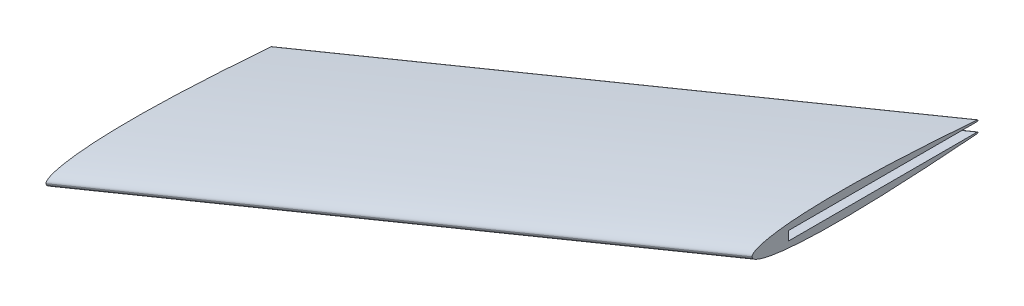
ISO-10303-21;
HEADER;
FILE_DESCRIPTION(('STEP AP214'),'2;1');
FILE_NAME('part.step','',(''),(''),'','','');
FILE_SCHEMA(('AUTOMOTIVE_DESIGN { 1 0 10303 214 1 1 1 1 }'));
ENDSEC;
DATA;
#1=APPLICATION_CONTEXT('core data for automotive mechanical design processes');
#2=APPLICATION_PROTOCOL_DEFINITION('international standard','automotive_design',2000,#1);
#3=PRODUCT_CONTEXT('',#1,'mechanical');
#4=PRODUCT('Part','Part','',(#3));
#5=PRODUCT_RELATED_PRODUCT_CATEGORY('part','',(#4));
#6=PRODUCT_DEFINITION_FORMATION('','',#4);
#7=PRODUCT_DEFINITION_CONTEXT('part definition',#1,'design');
#8=PRODUCT_DEFINITION('design','',#6,#7);
#9=PRODUCT_DEFINITION_SHAPE('','',#8);
#10=(LENGTH_UNIT() NAMED_UNIT(*) SI_UNIT(.MILLI.,.METRE.));
#11=(NAMED_UNIT(*) PLANE_ANGLE_UNIT() SI_UNIT($,.RADIAN.));
#12=(NAMED_UNIT(*) SI_UNIT($,.STERADIAN.) SOLID_ANGLE_UNIT());
#13=UNCERTAINTY_MEASURE_WITH_UNIT(LENGTH_MEASURE(1.E-05),#10,'distance_accuracy_value','');
#14=(GEOMETRIC_REPRESENTATION_CONTEXT(3) GLOBAL_UNCERTAINTY_ASSIGNED_CONTEXT((#13)) GLOBAL_UNIT_ASSIGNED_CONTEXT((#10,
#11,#12)) REPRESENTATION_CONTEXT('',''));
#15=CARTESIAN_POINT('',(0.,0.,0.));
#16=DIRECTION('',(0.,0.,1.));
#17=DIRECTION('',(1.,0.,0.));
#18=AXIS2_PLACEMENT_3D('',#15,#16,#17);
#19=CARTESIAN_POINT('',(0.,-3.93630136520554,-50.3633396765371));
#20=DIRECTION('',(-1.,0.,0.));
#21=DIRECTION('',(0.,0.,1.));
#22=AXIS2_PLACEMENT_3D('',#19,#20,#21);
#23=PLANE('',#22);
#24=CARTESIAN_POINT('',(0.,2.54861150100517E-12,-101.599999999976));
#25=CARTESIAN_POINT('',(0.,0.225695101560409,-99.4704870264086));
#26=CARTESIAN_POINT('',(0.,0.65886210598078,-95.2095458926836));
#27=CARTESIAN_POINT('',(0.,1.26034650042552,-88.8134130651818));
#28=CARTESIAN_POINT('',(0.,1.81773094502803,-82.413295725226));
#29=CARTESIAN_POINT('',(0.,2.3334078948735,-76.009684423251));
#30=CARTESIAN_POINT('',(0.,2.80755127702244,-69.6028612655314));
#31=CARTESIAN_POINT('',(0.,3.23807149773911,-63.192954833482));
#32=CARTESIAN_POINT('',(0.,3.55674285252335,-57.8488146569175));
#33=CARTESIAN_POINT('',(0.,3.78387223593398,-53.571957090878));
#34=CARTESIAN_POINT('',(0.,3.93906378336686,-50.3635453899566));
#35=CARTESIAN_POINT('',(0.,4.0776525271027,-47.1543703970731));
#36=CARTESIAN_POINT('',(0.,4.19790552046581,-43.9444540109084));
#37=CARTESIAN_POINT('',(0.,4.29786908261221,-40.7338381569067));
#38=CARTESIAN_POINT('',(0.,4.37517398808628,-37.5225923619446));
#39=CARTESIAN_POINT('',(0.,4.42706541009988,-34.3108288824663));
#40=CARTESIAN_POINT('',(0.,4.45025530198853,-31.0987219939535));
#41=CARTESIAN_POINT('',(0.,4.44077441828673,-27.886533898393));
#42=CARTESIAN_POINT('',(0.,4.39397945215696,-24.6746580157806));
#43=CARTESIAN_POINT('',(0.,4.30361480041229,-21.4636861396445));
#44=CARTESIAN_POINT('',(0.,4.16208115973278,-18.2545326432964));
#45=CARTESIAN_POINT('',(0.,3.99247119601058,-15.5829555485085));
#46=CARTESIAN_POINT('',(0.,3.81769318950308,-13.4486103287218));
#47=CARTESIAN_POINT('',(0.,3.66460232301028,-11.8498063564616));
#48=CARTESIAN_POINT('',(0.,3.48602822407744,-10.2536245101371));
#49=CARTESIAN_POINT('',(0.,3.3113852390776,-8.92658905001923));
#50=CARTESIAN_POINT('',(0.,3.15256878378683,-7.86768898861205));
#51=CARTESIAN_POINT('',(0.,3.0227874224503,-7.0751886743242));
#52=CARTESIAN_POINT('',(0.,2.88118565385833,-6.28470573649004));
#53=CARTESIAN_POINT('',(0.,2.7257641197343,-5.49681477179139));
#54=CARTESIAN_POINT('',(0.,2.55372298624117,-4.71236448416742));
#55=CARTESIAN_POINT('',(0.,2.36131683362052,-3.93263319903811));
#56=CARTESIAN_POINT('',(0.,2.144244040788,-3.15935482863532));
#57=CARTESIAN_POINT('',(0.,1.93616920706569,-2.52310953069643));
#58=CARTESIAN_POINT('',(0.,1.74691887945617,-2.02219809666128));
#59=CARTESIAN_POINT('',(0.,1.59119718349834,-1.65205877586426));
#60=CARTESIAN_POINT('',(0.,1.41800056380232,-1.28956192702785));
#61=CARTESIAN_POINT('',(0.,1.2223478527946,-0.938824287836895));
#62=CARTESIAN_POINT('',(0.,0.996512737880182,-0.605770552714589));
#63=CARTESIAN_POINT('',(0.,0.728334690594297,-0.305943473628639));
#64=CARTESIAN_POINT('',(0.,0.399886581832634,-0.0668237898296112));
#65=CARTESIAN_POINT('',(0.,0.133839918645706,-0.000126317250917264));
#66=CARTESIAN_POINT('',(0.,-2.39394825902843E-07,-0.000126317247767354));
#67=B_SPLINE_CURVE_WITH_KNOTS('',3,(#24,#25,#26,#27,#28,#29,#30,#31,#32,#33,#34,#35,#36,#37,#38,
#39,#40,#41,#42,#43,#44,#45,#46,#47,#48,#49,#50,#51,#52,#53,#54,#55,#56,#57,#58,#59,#60,#61,#62,
#63,#64,#65,#66),.UNSPECIFIED.,.F.,.F.,(4,1,1,1,1,1,1,1,1,1,1,1,1,1,1,1,1,1,1,1,1,1,1,1,1,1,1,1,
1,1,1,1,1,1,1,1,1,1,1,1,4),(0.,0.0312500566752673,0.0625001133505346,0.0937501700258018,
0.125000226701069,0.156250283376336,0.187500340051604,0.218750396726871,0.234375425064505,
0.250000453402138,0.265625481739772,0.281250510077406,0.296875538415039,0.312500566752673,
0.328125595090307,0.34375062342794,0.359375651765574,0.375000680103207,0.390625708440841,
0.406250736778475,0.421875765116108,0.429688279284925,0.437500793453742,0.445313307622559,
0.453125821791376,0.457032078875784,0.460938335960193,0.464844593044601,0.468750850129009,
0.472657107213418,0.476563364297826,0.480469621382234,0.484375878466643,0.486329007008847,
0.488282135551051,0.490235264093256,0.49218839263546,0.494141521177664,0.496094649719868,
0.498047778262072,0.500000906804277),.UNSPECIFIED.);
#68=CARTESIAN_POINT('',(0.,2.09431435603325,-78.9568958891163));
#69=VERTEX_POINT('',#68);
#70=CARTESIAN_POINT('',(0.,-2.39394825946211E-07,-0.000126317247767839));
#71=VERTEX_POINT('',#70);
#72=EDGE_CURVE('E173',#69,#71,#67,.T.);
#73=ORIENTED_EDGE('',*,*,#72,.F.);
#74=CARTESIAN_POINT('',(0.,1.8415,-78.9267815057711));
#75=DIRECTION('',(-1.,0.,0.));
#76=DIRECTION('',(0.,0.,-1.));
#77=AXIS2_PLACEMENT_3D('',#74,#75,#76);
#78=ELLIPSE('',#77,0.309414533429127,0.254);
#79=CARTESIAN_POINT('',(0.,1.5875,-78.9267815057711));
#80=VERTEX_POINT('',#79);
#81=EDGE_CURVE('E120',#69,#80,#78,.T.);
#82=ORIENTED_EDGE('',*,*,#81,.T.);
#83=DIRECTION('',(0.,0.,1.));
#84=VECTOR('',#83,1.);
#85=CARTESIAN_POINT('',(0.,1.5875,0.));
#86=LINE('',#85,#84);
#87=CARTESIAN_POINT('',(0.,1.5875,-12.7));
#88=VERTEX_POINT('',#87);
#89=EDGE_CURVE('E115',#80,#88,#86,.T.);
#90=ORIENTED_EDGE('',*,*,#89,.T.);
#91=DIRECTION('',(0.,1.,0.));
#92=VECTOR('',#91,1.);
#93=CARTESIAN_POINT('',(0.,-1.5875,-12.7));
#94=LINE('',#93,#92);
#95=CARTESIAN_POINT('',(0.,-1.5875,-12.7));
#96=VERTEX_POINT('',#95);
#97=EDGE_CURVE('E118',#96,#88,#94,.T.);
#98=ORIENTED_EDGE('',*,*,#97,.F.);
#99=DIRECTION('',(0.,0.,-1.));
#100=VECTOR('',#99,1.);
#101=CARTESIAN_POINT('',(0.,-1.5875,0.));
#102=LINE('',#101,#100);
#103=CARTESIAN_POINT('',(0.,-1.5875,-78.9267815063098));
#104=VERTEX_POINT('',#103);
#105=EDGE_CURVE('E142',#96,#104,#102,.T.);
#106=ORIENTED_EDGE('',*,*,#105,.T.);
#107=CARTESIAN_POINT('',(0.,-1.8415,-78.9267815063098));
#108=DIRECTION('',(-1.,0.,0.));
#109=DIRECTION('',(0.,0.,-1.));
#110=AXIS2_PLACEMENT_3D('',#107,#108,#109);
#111=ELLIPSE('',#110,0.309414533429127,0.254);
#112=CARTESIAN_POINT('',(0.,-2.09431367169332,-78.956895834746));
#113=VERTEX_POINT('',#112);
#114=EDGE_CURVE('E72',#104,#113,#111,.T.);
#115=ORIENTED_EDGE('',*,*,#114,.T.);
#116=CARTESIAN_POINT('',(0.,-2.39394825902843E-07,-0.000126317247767354));
#117=CARTESIAN_POINT('',(0.,-0.133839911968929,-0.000126317244617454));
#118=CARTESIAN_POINT('',(0.,-0.399886586729944,-0.0668237898342488));
#119=CARTESIAN_POINT('',(0.,-0.728334688258186,-0.305943473626528));
#120=CARTESIAN_POINT('',(0.,-0.996512739087661,-0.60577055271586));
#121=CARTESIAN_POINT('',(0.,-1.22234785219313,-0.938824287836555));
#122=CARTESIAN_POINT('',(0.,-1.41800056407907,-1.28956192702838));
#123=CARTESIAN_POINT('',(0.,-1.59119718338213,-1.65205877586447));
#124=CARTESIAN_POINT('',(0.,-1.74691887951622,-2.0221980966617));
#125=CARTESIAN_POINT('',(0.,-1.93616920702529,-2.52310953069682));
#126=CARTESIAN_POINT('',(0.,-2.14424404081486,-3.15935482863588));
#127=CARTESIAN_POINT('',(0.,-2.36131683360865,-3.93263319903871));
#128=CARTESIAN_POINT('',(0.,-2.55372298624656,-4.71236448416817));
#129=CARTESIAN_POINT('',(0.,-2.72576411973127,-5.49681477179222));
#130=CARTESIAN_POINT('',(0.,-2.88118565386015,-6.28470573649098));
#131=CARTESIAN_POINT('',(0.,-3.02278742244949,-7.07518867432524));
#132=CARTESIAN_POINT('',(0.,-3.15256878378733,-7.86768898861323));
#133=CARTESIAN_POINT('',(0.,-3.31138523907733,-8.92658905002045));
#134=CARTESIAN_POINT('',(0.,-3.48602822407766,-10.2536245101385));
#135=CARTESIAN_POINT('',(0.,-3.66460232301021,-11.8498063564632));
#136=CARTESIAN_POINT('',(0.,-3.81769318950311,-13.4486103287235));
#137=CARTESIAN_POINT('',(0.,-3.99247119601048,-15.5829555485107));
#138=CARTESIAN_POINT('',(0.,-4.16208115973272,-18.2545326432983));
#139=CARTESIAN_POINT('',(0.,-4.30361480041202,-21.463686139648));
#140=CARTESIAN_POINT('',(0.,-4.39397945215689,-24.6746580157821));
#141=CARTESIAN_POINT('',(0.,-4.44077441828606,-27.8865338983996));
#142=CARTESIAN_POINT('',(0.,-4.45025530198876,-31.0987219939515));
#143=CARTESIAN_POINT('',(0.,-4.42706541009821,-34.3108288824816));
#144=CARTESIAN_POINT('',(0.,-4.37517398808784,-37.5225923619292));
#145=CARTESIAN_POINT('',(0.,-4.29786908260813,-40.7338381569439));
#146=CARTESIAN_POINT('',(0.,-4.19790552047065,-43.9444540108612));
#147=CARTESIAN_POINT('',(0.,-4.07765252708977,-47.154370397193));
#148=CARTESIAN_POINT('',(0.,-3.93906378338904,-50.3635453897448));
#149=CARTESIAN_POINT('',(0.,-3.7838722358928,-53.5719570912634));
#150=CARTESIAN_POINT('',(0.,-3.55674285260024,-57.8488146561884));
#151=CARTESIAN_POINT('',(0.,-3.23807149757933,-63.192954834985));
#152=CARTESIAN_POINT('',(0.,-2.80755127740399,-69.6028612619259));
#153=CARTESIAN_POINT('',(0.,-2.33340789402628,-76.0096844312382));
#154=CARTESIAN_POINT('',(0.,-1.81773094645022,-82.4132957117994));
#155=CARTESIAN_POINT('',(0.,-1.26034649745129,-88.8134130932356));
#156=CARTESIAN_POINT('',(0.,-0.658862112954847,-95.2095458268705));
#157=CARTESIAN_POINT('',(0.,-0.225695090298832,-99.470487132654));
#158=CARTESIAN_POINT('',(0.,0.,-101.599999999988));
#159=B_SPLINE_CURVE_WITH_KNOTS('',3,(#116,#117,#118,#119,#120,#121,#122,#123,#124,#125,#126,
#127,#128,#129,#130,#131,#132,#133,#134,#135,#136,#137,#138,#139,#140,#141,#142,#143,#144,#145,
#146,#147,#148,#149,#150,#151,#152,#153,#154,#155,#156,#157,#158),.UNSPECIFIED.,.F.,.F.,(4,1,1,
1,1,1,1,1,1,1,1,1,1,1,1,1,1,1,1,1,1,1,1,1,1,1,1,1,1,1,1,1,1,1,1,1,1,1,1,1,4),(0.500000906804277,
0.501954028262072,0.503907149719868,0.505860271177664,0.50781339263546,0.509766514093256,
0.511719635551051,0.513672757008847,0.515625878466643,0.519532121382235,0.523438364297826,
0.527344607213418,0.531250850129009,0.535157093044601,0.539063335960193,0.542969578875784,
0.546875821791376,0.554688307622559,0.562500793453742,0.570313279284925,0.578125765116108,
0.593750736778475,0.609375708440841,0.625000680103208,0.640625651765574,0.65625062342794,
0.671875595090307,0.687500566752673,0.703125538415039,0.718750510077406,0.734375481739772,
0.750000453402138,0.765625425064505,0.781250396726871,0.812500340051604,0.843750283376337,
0.875000226701069,0.906250170025802,0.937500113350535,0.968750056675267,1.),.UNSPECIFIED.);
#160=EDGE_CURVE('E262',#71,#113,#159,.T.);
#161=ORIENTED_EDGE('',*,*,#160,.F.);
#162=EDGE_LOOP('',(#73,#82,#90,#98,#106,#115,#161));
#163=FACE_BOUND('',#162,.T.);
#164=ADVANCED_FACE('F57',(#163),#23,.T.);
#165=CARTESIAN_POINT('',(146.05,-3.93630136520556,-151.963339676537));
#166=DIRECTION('',(-1.,0.,0.));
#167=DIRECTION('',(0.,0.,1.));
#168=AXIS2_PLACEMENT_3D('',#165,#166,#167);
#169=PLANE('',#168);
#170=DIRECTION('',(0.,0.,-1.));
#171=VECTOR('',#170,1.);
#172=CARTESIAN_POINT('',(146.05,1.5875,0.));
#173=LINE('',#172,#171);
#174=CARTESIAN_POINT('',(146.05,1.5875,-114.3));
#175=VERTEX_POINT('',#174);
#176=CARTESIAN_POINT('',(146.05,1.5875,-180.526781505771));
#177=VERTEX_POINT('',#176);
#178=EDGE_CURVE('E126',#175,#177,#173,.T.);
#179=ORIENTED_EDGE('',*,*,#178,.T.);
#180=CARTESIAN_POINT('',(146.05,1.8415,-180.526781505771));
#181=DIRECTION('',(-1.,0.,0.));
#182=DIRECTION('',(0.,0.,-1.));
#183=AXIS2_PLACEMENT_3D('',#180,#181,#182);
#184=ELLIPSE('',#183,0.309414533429127,0.254);
#185=CARTESIAN_POINT('',(146.05,2.09431367171324,-180.556895834633));
#186=VERTEX_POINT('',#185);
#187=EDGE_CURVE('E161',#177,#186,#184,.F.);
#188=ORIENTED_EDGE('',*,*,#187,.T.);
#189=CARTESIAN_POINT('',(146.05,-2.39394825902843E-07,-101.600126317248));
#190=CARTESIAN_POINT('',(146.05,0.133839918645706,-101.600126317251));
#191=CARTESIAN_POINT('',(146.05,0.399886581832717,-101.66682378983));
#192=CARTESIAN_POINT('',(146.05,0.728334690594311,-101.905943473629));
#193=CARTESIAN_POINT('',(146.05,0.996512737880149,-102.205770552715));
#194=CARTESIAN_POINT('',(146.05,1.22234785279472,-102.538824287837));
#195=CARTESIAN_POINT('',(146.05,1.41800056380244,-102.889561927028));
#196=CARTESIAN_POINT('',(146.05,1.59119718349841,-103.252058775864));
#197=CARTESIAN_POINT('',(146.05,1.74691887945616,-103.622198096661));
#198=CARTESIAN_POINT('',(146.05,1.93616920706565,-104.123109530697));
#199=CARTESIAN_POINT('',(146.05,2.14424404078799,-104.759354828635));
#200=CARTESIAN_POINT('',(146.05,2.36131683362055,-105.532633199038));
#201=CARTESIAN_POINT('',(146.05,2.55372298624123,-106.312364484167));
#202=CARTESIAN_POINT('',(146.05,2.72576411973437,-107.096814771792));
#203=CARTESIAN_POINT('',(146.05,2.88118565385838,-107.88470573649));
#204=CARTESIAN_POINT('',(146.05,3.02278742245035,-108.675188674324));
#205=CARTESIAN_POINT('',(146.05,3.15256878378684,-109.467688988612));
#206=CARTESIAN_POINT('',(146.05,3.31138523907757,-110.526589050019));
#207=CARTESIAN_POINT('',(146.05,3.48602822407739,-111.853624510137));
#208=CARTESIAN_POINT('',(146.05,3.66460232301024,-113.449806356462));
#209=CARTESIAN_POINT('',(146.05,3.81769318950307,-115.048610328722));
#210=CARTESIAN_POINT('',(146.05,3.99247119601062,-117.182955548509));
#211=CARTESIAN_POINT('',(146.05,4.16208115973284,-119.854532643296));
#212=CARTESIAN_POINT('',(146.05,4.30361480041229,-123.063686139644));
#213=CARTESIAN_POINT('',(146.05,4.39397945215693,-126.274658015781));
#214=CARTESIAN_POINT('',(146.05,4.44077441828671,-129.486533898393));
#215=CARTESIAN_POINT('',(146.05,4.45025530198855,-132.698721993954));
#216=CARTESIAN_POINT('',(146.05,4.42706541009987,-135.910828882466));
#217=CARTESIAN_POINT('',(146.05,4.37517398808627,-139.122592361944));
#218=CARTESIAN_POINT('',(146.05,4.29786908261219,-142.333838156907));
#219=CARTESIAN_POINT('',(146.05,4.19790552046581,-145.544454010908));
#220=CARTESIAN_POINT('',(146.05,4.07765252710271,-148.754370397074));
#221=CARTESIAN_POINT('',(146.05,3.93906378336685,-151.963545389956));
#222=CARTESIAN_POINT('',(146.05,3.78387223593401,-155.171957090878));
#223=CARTESIAN_POINT('',(146.05,3.55674285252329,-159.448814656917));
#224=CARTESIAN_POINT('',(146.049999999999,3.23807149773914,-164.792954833482));
#225=CARTESIAN_POINT('',(146.050000000001,2.80755127702241,-171.202861265531));
#226=CARTESIAN_POINT('',(146.049999999999,2.33340789487354,-177.609684423251));
#227=CARTESIAN_POINT('',(146.05,1.81773094502803,-184.013295725226));
#228=CARTESIAN_POINT('',(146.05,1.26034650042556,-190.413413065182));
#229=CARTESIAN_POINT('',(146.05,0.658862105980768,-196.809545892684));
#230=CARTESIAN_POINT('',(146.05,0.225695101560401,-201.070487026408));
#231=CARTESIAN_POINT('',(146.05,2.5509929051439E-12,-203.199999999976));
#232=B_SPLINE_CURVE_WITH_KNOTS('',3,(#189,#190,#191,#192,#193,#194,#195,#196,#197,#198,#199,
#200,#201,#202,#203,#204,#205,#206,#207,#208,#209,#210,#211,#212,#213,#214,#215,#216,#217,#218,
#219,#220,#221,#222,#223,#224,#225,#226,#227,#228,#229,#230,#231),.UNSPECIFIED.,.F.,.F.,(4,1,1,
1,1,1,1,1,1,1,1,1,1,1,1,1,1,1,1,1,1,1,1,1,1,1,1,1,1,1,1,1,1,1,1,1,1,1,1,1,4),(0.,
0.0019531285422042,0.00390625708440839,0.00585938562661259,0.00781251416881695,
0.00976564271102109,0.0117187712532253,0.0136718997954295,0.0156250283376337,0.0195312854220422,
0.0234375425064505,0.0273437995908589,0.0312500566752674,0.0351563137596758,0.0390625708440842,
0.0429688279284927,0.0468750850129009,0.0546875991817179,0.0625001133505346,0.0703126275193514,
0.0781251416881684,0.0937501700258019,0.109375198363436,0.125000226701069,0.140625255038703,
0.156250283376337,0.17187531171397,0.187500340051604,0.203125368389237,0.218750396726871,
0.234375425064505,0.250000453402138,0.265625481739772,0.281250510077406,0.312500566752673,
0.34375062342794,0.375000680103208,0.406250736778475,0.437500793453742,0.468750850129009,
0.500000906804277),.UNSPECIFIED.);
#233=CARTESIAN_POINT('',(146.05,-2.39394825946211E-07,-101.600126317248));
#234=VERTEX_POINT('',#233);
#235=EDGE_CURVE('E261',#186,#234,#232,.F.);
#236=ORIENTED_EDGE('',*,*,#235,.T.);
#237=CARTESIAN_POINT('',(146.05,0.,-203.199999999988));
#238=CARTESIAN_POINT('',(146.05,-0.225695090298834,-201.070487132654));
#239=CARTESIAN_POINT('',(146.05,-0.658862112954819,-196.809545826871));
#240=CARTESIAN_POINT('',(146.05,-1.26034649745134,-190.413413093236));
#241=CARTESIAN_POINT('',(146.05,-1.81773094645022,-184.013295711799));
#242=CARTESIAN_POINT('',(146.05,-2.33340789402633,-177.609684431238));
#243=CARTESIAN_POINT('',(146.05,-2.80755127740396,-171.202861261926));
#244=CARTESIAN_POINT('',(146.05,-3.23807149757936,-164.792954834985));
#245=CARTESIAN_POINT('',(146.05,-3.5567428526002,-159.448814656188));
#246=CARTESIAN_POINT('',(146.05,-3.78387223589283,-155.171957091263));
#247=CARTESIAN_POINT('',(146.05,-3.93906378338904,-151.963545389745));
#248=CARTESIAN_POINT('',(146.05,-4.07765252708978,-148.754370397193));
#249=CARTESIAN_POINT('',(146.05,-4.19790552047066,-145.544454010861));
#250=CARTESIAN_POINT('',(146.05,-4.29786908260812,-142.333838156944));
#251=CARTESIAN_POINT('',(146.05,-4.37517398808783,-139.122592361929));
#252=CARTESIAN_POINT('',(146.05,-4.42706541009821,-135.910828882482));
#253=CARTESIAN_POINT('',(146.05,-4.45025530198877,-132.698721993951));
#254=CARTESIAN_POINT('',(146.05,-4.44077441828605,-129.4865338984));
#255=CARTESIAN_POINT('',(146.05,-4.39397945215686,-126.274658015782));
#256=CARTESIAN_POINT('',(146.05,-4.30361480041202,-123.063686139648));
#257=CARTESIAN_POINT('',(146.05,-4.16208115973279,-119.854532643298));
#258=CARTESIAN_POINT('',(146.05,-3.99247119601052,-117.182955548511));
#259=CARTESIAN_POINT('',(146.05,-3.8176931895031,-115.048610328723));
#260=CARTESIAN_POINT('',(146.05,-3.66460232301015,-113.449806356463));
#261=CARTESIAN_POINT('',(146.049999999999,-3.48602822407759,-111.853624510138));
#262=CARTESIAN_POINT('',(146.050000000001,-3.31138523907729,-110.526589050021));
#263=CARTESIAN_POINT('',(146.05,-3.15256878378731,-109.467688988613));
#264=CARTESIAN_POINT('',(146.05,-3.02278742244951,-108.675188674325));
#265=CARTESIAN_POINT('',(146.05,-2.88118565386017,-107.88470573649));
#266=CARTESIAN_POINT('',(146.05,-2.72576411973132,-107.096814771793));
#267=CARTESIAN_POINT('',(146.05,-2.55372298624658,-106.312364484168));
#268=CARTESIAN_POINT('',(146.05,-2.36131683360865,-105.532633199039));
#269=CARTESIAN_POINT('',(146.05,-2.14424404081483,-104.759354828636));
#270=CARTESIAN_POINT('',(146.05,-1.93616920702523,-104.123109530697));
#271=CARTESIAN_POINT('',(146.05,-1.74691887951619,-103.622198096662));
#272=CARTESIAN_POINT('',(146.05,-1.59119718338218,-103.252058775864));
#273=CARTESIAN_POINT('',(146.05,-1.41800056407916,-102.889561927028));
#274=CARTESIAN_POINT('',(146.05,-1.2223478521932,-102.538824287837));
#275=CARTESIAN_POINT('',(146.05,-0.9965127390876,-102.205770552716));
#276=CARTESIAN_POINT('',(146.05,-0.728334688258157,-101.905943473627));
#277=CARTESIAN_POINT('',(146.05,-0.399886586729987,-101.666823789834));
#278=CARTESIAN_POINT('',(146.05,-0.133839911968929,-101.600126317245));
#279=CARTESIAN_POINT('',(146.05,-2.39394825902843E-07,-101.600126317248));
#280=B_SPLINE_CURVE_WITH_KNOTS('',3,(#237,#238,#239,#240,#241,#242,#243,#244,#245,#246,#247,
#248,#249,#250,#251,#252,#253,#254,#255,#256,#257,#258,#259,#260,#261,#262,#263,#264,#265,#266,
#267,#268,#269,#270,#271,#272,#273,#274,#275,#276,#277,#278,#279),.UNSPECIFIED.,.F.,.F.,(4,1,1,
1,1,1,1,1,1,1,1,1,1,1,1,1,1,1,1,1,1,1,1,1,1,1,1,1,1,1,1,1,1,1,1,1,1,1,1,1,4),(0.500000906804277,
0.531250850129009,0.562500793453742,0.593750736778475,0.625000680103207,0.65625062342794,
0.687500566752673,0.718750510077406,0.734375481739772,0.750000453402138,0.765625425064504,
0.781250396726871,0.796875368389237,0.812500340051604,0.82812531171397,0.843750283376336,
0.859375255038703,0.875000226701069,0.890625198363435,0.906250170025802,0.921875141688168,
0.929687627519351,0.937500113350535,0.945312599181718,0.953125085012901,0.957031327928492,
0.960937570844084,0.964843813759676,0.968750056675267,0.972656299590859,0.97656254250645,
0.980468785422042,0.984375028337634,0.986328149795429,0.988281271253225,0.990234392711021,
0.992187514168817,0.994140635626613,0.996093757084408,0.998046878542204,1.),.UNSPECIFIED.);
#281=CARTESIAN_POINT('',(146.05,-2.09431435598182,-180.556895889637));
#282=VERTEX_POINT('',#281);
#283=EDGE_CURVE('E271',#234,#282,#280,.F.);
#284=ORIENTED_EDGE('',*,*,#283,.T.);
#285=CARTESIAN_POINT('',(146.05,-1.8415,-180.52678150631));
#286=DIRECTION('',(-1.,0.,0.));
#287=DIRECTION('',(0.,0.,-1.));
#288=AXIS2_PLACEMENT_3D('',#285,#286,#287);
#289=ELLIPSE('',#288,0.309414533429127,0.254);
#290=CARTESIAN_POINT('',(146.05,-1.5875,-180.52678150631));
#291=VERTEX_POINT('',#290);
#292=EDGE_CURVE('E159',#282,#291,#289,.F.);
#293=ORIENTED_EDGE('',*,*,#292,.T.);
#294=DIRECTION('',(0.,0.,1.));
#295=VECTOR('',#294,1.);
#296=CARTESIAN_POINT('',(146.05,-1.5875,0.));
#297=LINE('',#296,#295);
#298=CARTESIAN_POINT('',(146.05,-1.5875,-114.3));
#299=VERTEX_POINT('',#298);
#300=EDGE_CURVE('E140',#291,#299,#297,.T.);
#301=ORIENTED_EDGE('',*,*,#300,.T.);
#302=DIRECTION('',(0.,1.,0.));
#303=VECTOR('',#302,1.);
#304=CARTESIAN_POINT('',(146.05,-1.5875,-114.3));
#305=LINE('',#304,#303);
#306=EDGE_CURVE('E136',#299,#175,#305,.T.);
#307=ORIENTED_EDGE('',*,*,#306,.T.);
#308=EDGE_LOOP('',(#179,#188,#236,#284,#293,#301,#307));
#309=FACE_BOUND('',#308,.T.);
#310=ADVANCED_FACE('F226',(#309),#169,.F.);
#311=CARTESIAN_POINT('',(0.,-2.39394825902843E-07,-0.000126317247767354));
#312=CARTESIAN_POINT('',(146.05,-2.39394825902843E-07,-101.600126317248));
#313=CARTESIAN_POINT('',(0.,-0.133839911968929,-0.000126317244617454));
#314=CARTESIAN_POINT('',(146.05,-0.133839911968929,-101.600126317245));
#315=CARTESIAN_POINT('',(0.,-0.399886586729944,-0.0668237898342488));
#316=CARTESIAN_POINT('',(146.05,-0.399886586729987,-101.666823789834));
#317=CARTESIAN_POINT('',(0.,-0.728334688258186,-0.305943473626528));
#318=CARTESIAN_POINT('',(146.05,-0.728334688258157,-101.905943473627));
#319=CARTESIAN_POINT('',(0.,-0.996512739087661,-0.60577055271586));
#320=CARTESIAN_POINT('',(146.05,-0.9965127390876,-102.205770552716));
#321=CARTESIAN_POINT('',(0.,-1.22234785219313,-0.938824287836555));
#322=CARTESIAN_POINT('',(146.05,-1.2223478521932,-102.538824287837));
#323=CARTESIAN_POINT('',(0.,-1.41800056407907,-1.28956192702838));
#324=CARTESIAN_POINT('',(146.05,-1.41800056407916,-102.889561927028));
#325=CARTESIAN_POINT('',(0.,-1.59119718338213,-1.65205877586447));
#326=CARTESIAN_POINT('',(146.05,-1.59119718338218,-103.252058775864));
#327=CARTESIAN_POINT('',(0.,-1.74691887951622,-2.0221980966617));
#328=CARTESIAN_POINT('',(146.05,-1.74691887951619,-103.622198096662));
#329=CARTESIAN_POINT('',(0.,-1.93616920702529,-2.52310953069682));
#330=CARTESIAN_POINT('',(146.05,-1.93616920702523,-104.123109530697));
#331=CARTESIAN_POINT('',(0.,-2.14424404081486,-3.15935482863588));
#332=CARTESIAN_POINT('',(146.05,-2.14424404081483,-104.759354828636));
#333=CARTESIAN_POINT('',(0.,-2.36131683360865,-3.93263319903871));
#334=CARTESIAN_POINT('',(146.05,-2.36131683360865,-105.532633199039));
#335=CARTESIAN_POINT('',(0.,-2.55372298624656,-4.71236448416817));
#336=CARTESIAN_POINT('',(146.05,-2.55372298624658,-106.312364484168));
#337=CARTESIAN_POINT('',(0.,-2.72576411973127,-5.49681477179222));
#338=CARTESIAN_POINT('',(146.05,-2.72576411973132,-107.096814771793));
#339=CARTESIAN_POINT('',(0.,-2.88118565386015,-6.28470573649098));
#340=CARTESIAN_POINT('',(146.05,-2.88118565386017,-107.88470573649));
#341=CARTESIAN_POINT('',(0.,-3.02278742244949,-7.07518867432524));
#342=CARTESIAN_POINT('',(146.05,-3.02278742244951,-108.675188674325));
#343=CARTESIAN_POINT('',(0.,-3.15256878378733,-7.86768898861323));
#344=CARTESIAN_POINT('',(146.05,-3.15256878378731,-109.467688988613));
#345=CARTESIAN_POINT('',(0.,-3.31138523907733,-8.92658905002045));
#346=CARTESIAN_POINT('',(146.050000000001,-3.31138523907729,-110.526589050021));
#347=CARTESIAN_POINT('',(0.,-3.48602822407766,-10.2536245101385));
#348=CARTESIAN_POINT('',(146.049999999999,-3.48602822407759,-111.853624510138));
#349=CARTESIAN_POINT('',(0.,-3.66460232301021,-11.8498063564632));
#350=CARTESIAN_POINT('',(146.05,-3.66460232301015,-113.449806356463));
#351=CARTESIAN_POINT('',(0.,-3.81769318950311,-13.4486103287235));
#352=CARTESIAN_POINT('',(146.05,-3.8176931895031,-115.048610328723));
#353=CARTESIAN_POINT('',(0.,-3.99247119601048,-15.5829555485107));
#354=CARTESIAN_POINT('',(146.05,-3.99247119601052,-117.182955548511));
#355=CARTESIAN_POINT('',(0.,-4.16208115973272,-18.2545326432983));
#356=CARTESIAN_POINT('',(146.05,-4.16208115973279,-119.854532643298));
#357=CARTESIAN_POINT('',(0.,-4.30361480041202,-21.463686139648));
#358=CARTESIAN_POINT('',(146.05,-4.30361480041202,-123.063686139648));
#359=CARTESIAN_POINT('',(0.,-4.39397945215689,-24.6746580157821));
#360=CARTESIAN_POINT('',(146.05,-4.39397945215686,-126.274658015782));
#361=CARTESIAN_POINT('',(0.,-4.44077441828606,-27.8865338983996));
#362=CARTESIAN_POINT('',(146.05,-4.44077441828605,-129.4865338984));
#363=CARTESIAN_POINT('',(0.,-4.45025530198876,-31.0987219939515));
#364=CARTESIAN_POINT('',(146.05,-4.45025530198877,-132.698721993951));
#365=CARTESIAN_POINT('',(0.,-4.42706541009821,-34.3108288824816));
#366=CARTESIAN_POINT('',(146.05,-4.42706541009821,-135.910828882482));
#367=CARTESIAN_POINT('',(0.,-4.37517398808784,-37.5225923619292));
#368=CARTESIAN_POINT('',(146.05,-4.37517398808783,-139.122592361929));
#369=CARTESIAN_POINT('',(0.,-4.29786908260813,-40.7338381569439));
#370=CARTESIAN_POINT('',(146.05,-4.29786908260812,-142.333838156944));
#371=CARTESIAN_POINT('',(0.,-4.19790552047065,-43.9444540108612));
#372=CARTESIAN_POINT('',(146.05,-4.19790552047066,-145.544454010861));
#373=CARTESIAN_POINT('',(0.,-4.07765252708977,-47.154370397193));
#374=CARTESIAN_POINT('',(146.05,-4.07765252708978,-148.754370397193));
#375=CARTESIAN_POINT('',(0.,-3.93906378338904,-50.3635453897448));
#376=CARTESIAN_POINT('',(146.05,-3.93906378338904,-151.963545389745));
#377=CARTESIAN_POINT('',(0.,-3.7838722358928,-53.5719570912634));
#378=CARTESIAN_POINT('',(146.05,-3.78387223589283,-155.171957091263));
#379=CARTESIAN_POINT('',(0.,-3.55674285260024,-57.8488146561884));
#380=CARTESIAN_POINT('',(146.05,-3.5567428526002,-159.448814656188));
#381=CARTESIAN_POINT('',(0.,-3.23807149757933,-63.192954834985));
#382=CARTESIAN_POINT('',(146.05,-3.23807149757936,-164.792954834985));
#383=CARTESIAN_POINT('',(0.,-2.80755127740399,-69.6028612619259));
#384=CARTESIAN_POINT('',(146.05,-2.80755127740396,-171.202861261926));
#385=CARTESIAN_POINT('',(0.,-2.33340789402628,-76.0096844312382));
#386=CARTESIAN_POINT('',(146.05,-2.33340789402633,-177.609684431238));
#387=CARTESIAN_POINT('',(0.,-1.81773094645022,-82.4132957117994));
#388=CARTESIAN_POINT('',(146.05,-1.81773094645022,-184.013295711799));
#389=CARTESIAN_POINT('',(0.,-1.26034649745129,-88.8134130932356));
#390=CARTESIAN_POINT('',(146.05,-1.26034649745134,-190.413413093236));
#391=CARTESIAN_POINT('',(0.,-0.658862112954847,-95.2095458268705));
#392=CARTESIAN_POINT('',(146.05,-0.658862112954819,-196.809545826871));
#393=CARTESIAN_POINT('',(0.,-0.225695090298832,-99.470487132654));
#394=CARTESIAN_POINT('',(146.05,-0.225695090298834,-201.070487132654));
#395=CARTESIAN_POINT('',(0.,0.,-101.599999999988));
#396=CARTESIAN_POINT('',(146.05,0.,-203.199999999988));
#397=B_SPLINE_SURFACE_WITH_KNOTS('',3,1,((#311,#312),(#313,#314),(#315,#316),(#317,#318),(#319,
#320),(#321,#322),(#323,#324),(#325,#326),(#327,#328),(#329,#330),(#331,#332),(#333,#334),(#335,
#336),(#337,#338),(#339,#340),(#341,#342),(#343,#344),(#345,#346),(#347,#348),(#349,#350),(#351,
#352),(#353,#354),(#355,#356),(#357,#358),(#359,#360),(#361,#362),(#363,#364),(#365,#366),(#367,
#368),(#369,#370),(#371,#372),(#373,#374),(#375,#376),(#377,#378),(#379,#380),(#381,#382),(#383,
#384),(#385,#386),(#387,#388),(#389,#390),(#391,#392),(#393,#394),(#395,#396)),.UNSPECIFIED.,
.F.,.F.,.F.,(4,1,1,1,1,1,1,1,1,1,1,1,1,1,1,1,1,1,1,1,1,1,1,1,1,1,1,1,1,1,1,1,1,1,1,1,1,1,1,1,4),
(2,2),(0.500000906804277,0.501954028262072,0.503907149719868,0.505860271177664,0.50781339263546,
0.509766514093256,0.511719635551051,0.513672757008847,0.515625878466643,0.519532121382235,
0.523438364297826,0.527344607213418,0.531250850129009,0.535157093044601,0.539063335960193,
0.542969578875784,0.546875821791376,0.554688307622559,0.562500793453742,0.570313279284925,
0.578125765116108,0.593750736778475,0.609375708440841,0.625000680103208,0.640625651765574,
0.65625062342794,0.671875595090307,0.687500566752673,0.703125538415039,0.718750510077406,
0.734375481739772,0.750000453402138,0.765625425064505,0.781250396726871,0.812500340051604,
0.843750283376337,0.875000226701069,0.906250170025802,0.937500113350535,0.968750056675267,1.),
(0.,1.),.UNSPECIFIED.);
#398=DIRECTION('',(0.820905201785487,0.,-0.5710644881986));
#399=VECTOR('',#398,1.);
#400=CARTESIAN_POINT('',(0.,-2.094294254153,-78.9568942772715));
#401=LINE('',#400,#399);
#402=EDGE_CURVE('E65',#113,#282,#401,.T.);
#403=DIRECTION('',(0.820905201785487,0.,-0.5710644881986));
#404=VECTOR('',#403,1.);
#405=CARTESIAN_POINT('',(73.025,-2.39394825902843E-07,-50.8001263172478));
#406=LINE('',#405,#404);
#407=EDGE_CURVE('E275',#71,#234,#406,.T.);
#408=ORIENTED_EDGE('',*,*,#160,.T.);
#409=ORIENTED_EDGE('',*,*,#402,.T.);
#410=ORIENTED_EDGE('',*,*,#283,.F.);
#411=ORIENTED_EDGE('',*,*,#407,.F.);
#412=EDGE_LOOP('',(#408,#409,#410,#411));
#413=FACE_BOUND('',#412,.T.);
#414=ADVANCED_FACE('F198',(#413),#397,.T.);
#415=CARTESIAN_POINT('',(0.,2.54861150100517E-12,-101.599999999976));
#416=CARTESIAN_POINT('',(146.05,2.5509929051439E-12,-203.199999999976));
#417=CARTESIAN_POINT('',(0.,0.225695101560409,-99.4704870264086));
#418=CARTESIAN_POINT('',(146.05,0.225695101560401,-201.070487026408));
#419=CARTESIAN_POINT('',(0.,0.65886210598078,-95.2095458926836));
#420=CARTESIAN_POINT('',(146.05,0.658862105980768,-196.809545892684));
#421=CARTESIAN_POINT('',(0.,1.26034650042552,-88.8134130651818));
#422=CARTESIAN_POINT('',(146.05,1.26034650042556,-190.413413065182));
#423=CARTESIAN_POINT('',(0.,1.81773094502803,-82.413295725226));
#424=CARTESIAN_POINT('',(146.05,1.81773094502803,-184.013295725226));
#425=CARTESIAN_POINT('',(0.,2.3334078948735,-76.009684423251));
#426=CARTESIAN_POINT('',(146.049999999999,2.33340789487354,-177.609684423251));
#427=CARTESIAN_POINT('',(0.,2.80755127702244,-69.6028612655314));
#428=CARTESIAN_POINT('',(146.050000000001,2.80755127702241,-171.202861265531));
#429=CARTESIAN_POINT('',(0.,3.23807149773911,-63.192954833482));
#430=CARTESIAN_POINT('',(146.049999999999,3.23807149773914,-164.792954833482));
#431=CARTESIAN_POINT('',(0.,3.55674285252335,-57.8488146569175));
#432=CARTESIAN_POINT('',(146.05,3.55674285252329,-159.448814656917));
#433=CARTESIAN_POINT('',(0.,3.78387223593398,-53.571957090878));
#434=CARTESIAN_POINT('',(146.05,3.78387223593401,-155.171957090878));
#435=CARTESIAN_POINT('',(0.,3.93906378336686,-50.3635453899566));
#436=CARTESIAN_POINT('',(146.05,3.93906378336685,-151.963545389956));
#437=CARTESIAN_POINT('',(0.,4.0776525271027,-47.1543703970731));
#438=CARTESIAN_POINT('',(146.05,4.07765252710271,-148.754370397074));
#439=CARTESIAN_POINT('',(0.,4.19790552046581,-43.9444540109084));
#440=CARTESIAN_POINT('',(146.05,4.19790552046581,-145.544454010908));
#441=CARTESIAN_POINT('',(0.,4.29786908261221,-40.7338381569067));
#442=CARTESIAN_POINT('',(146.05,4.29786908261219,-142.333838156907));
#443=CARTESIAN_POINT('',(0.,4.37517398808628,-37.5225923619446));
#444=CARTESIAN_POINT('',(146.05,4.37517398808627,-139.122592361944));
#445=CARTESIAN_POINT('',(0.,4.42706541009988,-34.3108288824663));
#446=CARTESIAN_POINT('',(146.05,4.42706541009987,-135.910828882466));
#447=CARTESIAN_POINT('',(0.,4.45025530198853,-31.0987219939535));
#448=CARTESIAN_POINT('',(146.05,4.45025530198855,-132.698721993954));
#449=CARTESIAN_POINT('',(0.,4.44077441828673,-27.886533898393));
#450=CARTESIAN_POINT('',(146.05,4.44077441828671,-129.486533898393));
#451=CARTESIAN_POINT('',(0.,4.39397945215696,-24.6746580157806));
#452=CARTESIAN_POINT('',(146.05,4.39397945215693,-126.274658015781));
#453=CARTESIAN_POINT('',(0.,4.30361480041229,-21.4636861396445));
#454=CARTESIAN_POINT('',(146.05,4.30361480041229,-123.063686139644));
#455=CARTESIAN_POINT('',(0.,4.16208115973278,-18.2545326432964));
#456=CARTESIAN_POINT('',(146.05,4.16208115973284,-119.854532643296));
#457=CARTESIAN_POINT('',(0.,3.99247119601058,-15.5829555485085));
#458=CARTESIAN_POINT('',(146.05,3.99247119601062,-117.182955548509));
#459=CARTESIAN_POINT('',(0.,3.81769318950308,-13.4486103287218));
#460=CARTESIAN_POINT('',(146.05,3.81769318950307,-115.048610328722));
#461=CARTESIAN_POINT('',(0.,3.66460232301028,-11.8498063564616));
#462=CARTESIAN_POINT('',(146.05,3.66460232301024,-113.449806356462));
#463=CARTESIAN_POINT('',(0.,3.48602822407744,-10.2536245101371));
#464=CARTESIAN_POINT('',(146.05,3.48602822407739,-111.853624510137));
#465=CARTESIAN_POINT('',(0.,3.3113852390776,-8.92658905001923));
#466=CARTESIAN_POINT('',(146.05,3.31138523907757,-110.526589050019));
#467=CARTESIAN_POINT('',(0.,3.15256878378683,-7.86768898861205));
#468=CARTESIAN_POINT('',(146.05,3.15256878378684,-109.467688988612));
#469=CARTESIAN_POINT('',(0.,3.0227874224503,-7.0751886743242));
#470=CARTESIAN_POINT('',(146.05,3.02278742245035,-108.675188674324));
#471=CARTESIAN_POINT('',(0.,2.88118565385833,-6.28470573649004));
#472=CARTESIAN_POINT('',(146.05,2.88118565385838,-107.88470573649));
#473=CARTESIAN_POINT('',(0.,2.7257641197343,-5.49681477179139));
#474=CARTESIAN_POINT('',(146.05,2.72576411973437,-107.096814771792));
#475=CARTESIAN_POINT('',(0.,2.55372298624117,-4.71236448416742));
#476=CARTESIAN_POINT('',(146.05,2.55372298624123,-106.312364484167));
#477=CARTESIAN_POINT('',(0.,2.36131683362052,-3.93263319903811));
#478=CARTESIAN_POINT('',(146.05,2.36131683362055,-105.532633199038));
#479=CARTESIAN_POINT('',(0.,2.144244040788,-3.15935482863532));
#480=CARTESIAN_POINT('',(146.05,2.14424404078799,-104.759354828635));
#481=CARTESIAN_POINT('',(0.,1.93616920706569,-2.52310953069643));
#482=CARTESIAN_POINT('',(146.05,1.93616920706565,-104.123109530697));
#483=CARTESIAN_POINT('',(0.,1.74691887945617,-2.02219809666128));
#484=CARTESIAN_POINT('',(146.05,1.74691887945616,-103.622198096661));
#485=CARTESIAN_POINT('',(0.,1.59119718349834,-1.65205877586426));
#486=CARTESIAN_POINT('',(146.05,1.59119718349841,-103.252058775864));
#487=CARTESIAN_POINT('',(0.,1.41800056380232,-1.28956192702785));
#488=CARTESIAN_POINT('',(146.05,1.41800056380244,-102.889561927028));
#489=CARTESIAN_POINT('',(0.,1.2223478527946,-0.938824287836895));
#490=CARTESIAN_POINT('',(146.05,1.22234785279472,-102.538824287837));
#491=CARTESIAN_POINT('',(0.,0.996512737880182,-0.605770552714589));
#492=CARTESIAN_POINT('',(146.05,0.996512737880149,-102.205770552715));
#493=CARTESIAN_POINT('',(0.,0.728334690594297,-0.305943473628639));
#494=CARTESIAN_POINT('',(146.05,0.728334690594311,-101.905943473629));
#495=CARTESIAN_POINT('',(0.,0.399886581832634,-0.0668237898296112));
#496=CARTESIAN_POINT('',(146.05,0.399886581832717,-101.66682378983));
#497=CARTESIAN_POINT('',(0.,0.133839918645706,-0.000126317250917264));
#498=CARTESIAN_POINT('',(146.05,0.133839918645706,-101.600126317251));
#499=CARTESIAN_POINT('',(0.,-2.39394825902843E-07,-0.000126317247767354));
#500=CARTESIAN_POINT('',(146.05,-2.39394825902843E-07,-101.600126317248));
#501=B_SPLINE_SURFACE_WITH_KNOTS('',3,1,((#415,#416),(#417,#418),(#419,#420),(#421,#422),(#423,
#424),(#425,#426),(#427,#428),(#429,#430),(#431,#432),(#433,#434),(#435,#436),(#437,#438),(#439,
#440),(#441,#442),(#443,#444),(#445,#446),(#447,#448),(#449,#450),(#451,#452),(#453,#454),(#455,
#456),(#457,#458),(#459,#460),(#461,#462),(#463,#464),(#465,#466),(#467,#468),(#469,#470),(#471,
#472),(#473,#474),(#475,#476),(#477,#478),(#479,#480),(#481,#482),(#483,#484),(#485,#486),(#487,
#488),(#489,#490),(#491,#492),(#493,#494),(#495,#496),(#497,#498),(#499,#500)),.UNSPECIFIED.,
.F.,.F.,.F.,(4,1,1,1,1,1,1,1,1,1,1,1,1,1,1,1,1,1,1,1,1,1,1,1,1,1,1,1,1,1,1,1,1,1,1,1,1,1,1,1,4),
(2,2),(0.,0.0312500566752673,0.0625001133505346,0.0937501700258018,0.125000226701069,
0.156250283376336,0.187500340051604,0.218750396726871,0.234375425064505,0.250000453402138,
0.265625481739772,0.281250510077406,0.296875538415039,0.312500566752673,0.328125595090307,
0.34375062342794,0.359375651765574,0.375000680103207,0.390625708440841,0.406250736778475,
0.421875765116108,0.429688279284925,0.437500793453742,0.445313307622559,0.453125821791376,
0.457032078875784,0.460938335960193,0.464844593044601,0.468750850129009,0.472657107213418,
0.476563364297826,0.480469621382234,0.484375878466643,0.486329007008847,0.488282135551051,
0.490235264093256,0.49218839263546,0.494141521177664,0.496094649719868,0.498047778262072,
0.500000906804277),(0.,1.),.UNSPECIFIED.);
#502=DIRECTION('',(0.820905201785488,0.,-0.571064488198599));
#503=VECTOR('',#502,1.);
#504=CARTESIAN_POINT('',(146.05,2.09429425415189,-180.556894276747));
#505=LINE('',#504,#503);
#506=EDGE_CURVE('E166',#186,#69,#505,.F.);
#507=ORIENTED_EDGE('',*,*,#235,.F.);
#508=ORIENTED_EDGE('',*,*,#506,.T.);
#509=ORIENTED_EDGE('',*,*,#72,.T.);
#510=ORIENTED_EDGE('',*,*,#407,.T.);
#511=EDGE_LOOP('',(#507,#508,#509,#510));
#512=FACE_BOUND('',#511,.T.);
#513=ADVANCED_FACE('F186',(#512),#501,.T.);
#514=CARTESIAN_POINT('',(-5.95363057324841,-1.5875,-8.55834394904458));
#515=DIRECTION('',(0.5710644881986,0.,0.820905201785487));
#516=DIRECTION('',(0.820905201785487,0.,-0.5710644881986));
#517=AXIS2_PLACEMENT_3D('',#514,#515,#516);
#518=PLANE('',#517);
#519=ORIENTED_EDGE('',*,*,#97,.T.);
#520=DIRECTION('',(0.820905201785487,0.,-0.5710644881986));
#521=VECTOR('',#520,1.);
#522=CARTESIAN_POINT('',(-5.95363057324841,1.5875,-8.55834394904458));
#523=LINE('',#522,#521);
#524=EDGE_CURVE('E125',#88,#175,#523,.T.);
#525=ORIENTED_EDGE('',*,*,#524,.T.);
#526=ORIENTED_EDGE('',*,*,#306,.F.);
#527=DIRECTION('',(0.820905201785487,0.,-0.5710644881986));
#528=VECTOR('',#527,1.);
#529=CARTESIAN_POINT('',(-5.95363057324841,-1.5875,-8.55834394904458));
#530=LINE('',#529,#528);
#531=EDGE_CURVE('E135',#96,#299,#530,.T.);
#532=ORIENTED_EDGE('',*,*,#531,.F.);
#533=EDGE_LOOP('',(#519,#525,#526,#532));
#534=FACE_BOUND('',#533,.T.);
#535=ADVANCED_FACE('F131',(#534),#518,.F.);
#536=CARTESIAN_POINT('',(0.,-1.5875,0.));
#537=DIRECTION('',(0.,1.,0.));
#538=DIRECTION('',(0.,0.,1.));
#539=AXIS2_PLACEMENT_3D('',#536,#537,#538);
#540=PLANE('',#539);
#541=ORIENTED_EDGE('',*,*,#300,.F.);
#542=DIRECTION('',(0.820905201785487,0.,-0.5710644881986));
#543=VECTOR('',#542,1.);
#544=CARTESIAN_POINT('',(-37.0000708207924,-1.5875,-53.187601804889));
#545=LINE('',#544,#543);
#546=EDGE_CURVE('E12',#291,#104,#545,.F.);
#547=ORIENTED_EDGE('',*,*,#546,.T.);
#548=ORIENTED_EDGE('',*,*,#105,.F.);
#549=ORIENTED_EDGE('',*,*,#531,.T.);
#550=EDGE_LOOP('',(#541,#547,#548,#549));
#551=FACE_BOUND('',#550,.T.);
#552=ADVANCED_FACE('F247',(#551),#540,.T.);
#553=CARTESIAN_POINT('',(0.,1.5875,0.));
#554=DIRECTION('',(0.,1.,0.));
#555=DIRECTION('',(0.,0.,1.));
#556=AXIS2_PLACEMENT_3D('',#553,#554,#555);
#557=PLANE('',#556);
#558=ORIENTED_EDGE('',*,*,#89,.F.);
#559=DIRECTION('',(-0.820905201785488,0.,0.571064488198599));
#560=VECTOR('',#559,1.);
#561=CARTESIAN_POINT('',(148.913240953094,1.5875,-182.518601299228));
#562=LINE('',#561,#560);
#563=EDGE_CURVE('E162',#80,#177,#562,.F.);
#564=ORIENTED_EDGE('',*,*,#563,.T.);
#565=ORIENTED_EDGE('',*,*,#178,.F.);
#566=ORIENTED_EDGE('',*,*,#524,.F.);
#567=EDGE_LOOP('',(#558,#564,#565,#566));
#568=FACE_BOUND('',#567,.T.);
#569=ADVANCED_FACE('F138',(#568),#557,.F.);
#570=CARTESIAN_POINT('',(75.8882409530938,1.8415,-131.718601299228));
#571=DIRECTION('',(0.820905201785488,0.,-0.571064488198599));
#572=DIRECTION('',(-0.571064488198599,0.,-0.820905201785488));
#573=AXIS2_PLACEMENT_3D('',#570,#571,#572);
#574=CYLINDRICAL_SURFACE('',#573,0.254);
#575=ORIENTED_EDGE('',*,*,#81,.F.);
#576=ORIENTED_EDGE('',*,*,#506,.F.);
#577=ORIENTED_EDGE('',*,*,#187,.F.);
#578=ORIENTED_EDGE('',*,*,#563,.F.);
#579=EDGE_LOOP('',(#575,#576,#577,#578));
#580=FACE_BOUND('',#579,.T.);
#581=ADVANCED_FACE('F238',(#580),#574,.T.);
#582=CARTESIAN_POINT('',(75.8882409523968,-1.8415,-131.718601299282));
#583=DIRECTION('',(0.820905201785487,0.,-0.5710644881986));
#584=DIRECTION('',(-0.5710644881986,0.,-0.820905201785487));
#585=AXIS2_PLACEMENT_3D('',#582,#583,#584);
#586=CYLINDRICAL_SURFACE('',#585,0.254);
#587=ORIENTED_EDGE('',*,*,#114,.F.);
#588=ORIENTED_EDGE('',*,*,#546,.F.);
#589=ORIENTED_EDGE('',*,*,#292,.F.);
#590=ORIENTED_EDGE('',*,*,#402,.F.);
#591=EDGE_LOOP('',(#587,#588,#589,#590));
#592=FACE_BOUND('',#591,.T.);
#593=ADVANCED_FACE('F59',(#592),#586,.T.);
#594=CLOSED_SHELL('',(#164,#310,#414,#513,#535,#552,#569,#581,#593));
#595=MANIFOLD_SOLID_BREP('B2',#594);
#596=ADVANCED_BREP_SHAPE_REPRESENTATION('',(#18,#595),#14);
#597=SHAPE_DEFINITION_REPRESENTATION(#9,#596);
ENDSEC;
END-ISO-10303-21;
